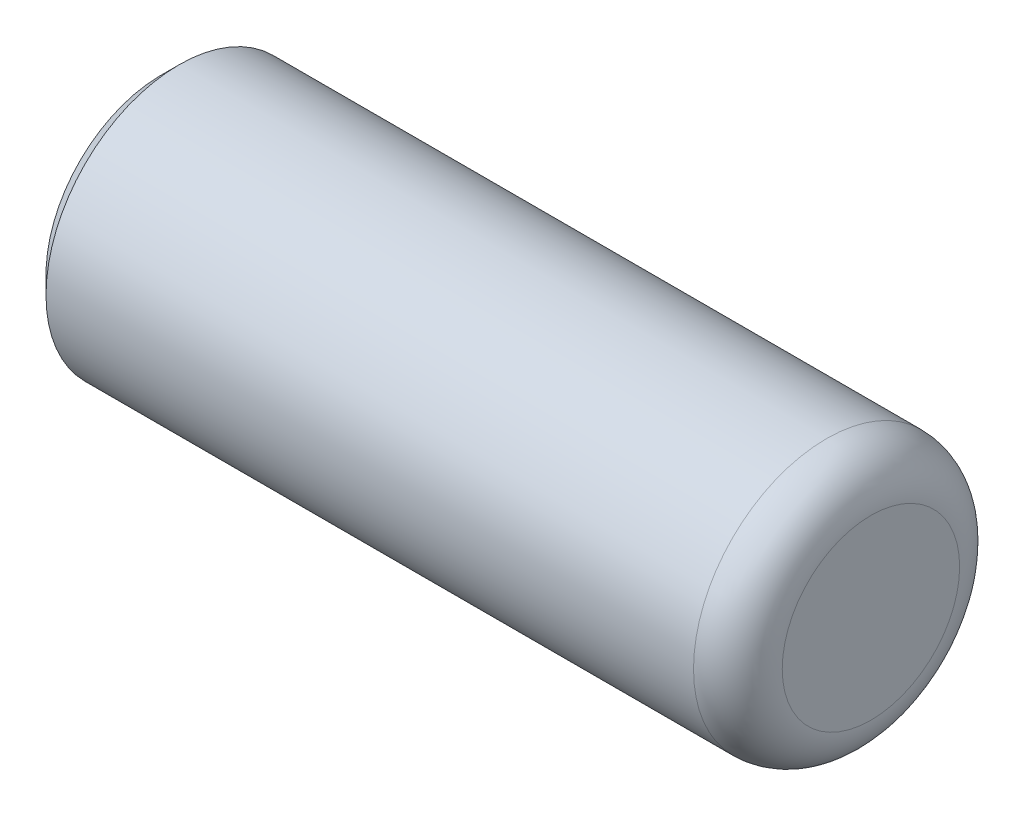
ISO-10303-21;
HEADER;
FILE_DESCRIPTION(('STEP AP214'),'2;1');
FILE_NAME('part.step','',(''),(''),'','','');
FILE_SCHEMA(('AUTOMOTIVE_DESIGN { 1 0 10303 214 1 1 1 1 }'));
ENDSEC;
DATA;
#1=APPLICATION_CONTEXT('core data for automotive mechanical design processes');
#2=APPLICATION_PROTOCOL_DEFINITION('international standard','automotive_design',2000,#1);
#3=PRODUCT_CONTEXT('',#1,'mechanical');
#4=PRODUCT('Part','Part','',(#3));
#5=PRODUCT_RELATED_PRODUCT_CATEGORY('part','',(#4));
#6=PRODUCT_DEFINITION_FORMATION('','',#4);
#7=PRODUCT_DEFINITION_CONTEXT('part definition',#1,'design');
#8=PRODUCT_DEFINITION('design','',#6,#7);
#9=PRODUCT_DEFINITION_SHAPE('','',#8);
#10=(LENGTH_UNIT() NAMED_UNIT(*) SI_UNIT(.MILLI.,.METRE.));
#11=(NAMED_UNIT(*) PLANE_ANGLE_UNIT() SI_UNIT($,.RADIAN.));
#12=(NAMED_UNIT(*) SI_UNIT($,.STERADIAN.) SOLID_ANGLE_UNIT());
#13=UNCERTAINTY_MEASURE_WITH_UNIT(LENGTH_MEASURE(1.E-05),#10,'distance_accuracy_value','');
#14=(GEOMETRIC_REPRESENTATION_CONTEXT(3) GLOBAL_UNCERTAINTY_ASSIGNED_CONTEXT((#13)) GLOBAL_UNIT_ASSIGNED_CONTEXT((#10,
#11,#12)) REPRESENTATION_CONTEXT('',''));
#15=CARTESIAN_POINT('',(0.,0.,0.));
#16=DIRECTION('',(0.,0.,1.));
#17=DIRECTION('',(1.,0.,0.));
#18=AXIS2_PLACEMENT_3D('',#15,#16,#17);
#19=CARTESIAN_POINT('',(4.,0.,0.));
#20=DIRECTION('',(-1.,0.,0.));
#21=DIRECTION('',(0.,0.,1.));
#22=AXIS2_PLACEMENT_3D('',#19,#20,#21);
#23=CYLINDRICAL_SURFACE('',#22,1.5);
#24=CARTESIAN_POINT('',(-3.8,0.,0.));
#25=DIRECTION('',(1.,0.,0.));
#26=DIRECTION('',(0.,0.,-1.));
#27=AXIS2_PLACEMENT_3D('',#24,#25,#26);
#28=CIRCLE('',#27,1.5);
#29=CARTESIAN_POINT('',(-3.8,0.,-1.5));
#30=VERTEX_POINT('',#29);
#31=EDGE_CURVE('E55',#30,#30,#28,.T.);
#32=ORIENTED_EDGE('',*,*,#31,.T.);
#33=EDGE_LOOP('',(#32));
#34=FACE_BOUND('',#33,.T.);
#35=CARTESIAN_POINT('',(3.5,0.,0.));
#36=DIRECTION('',(1.,0.,0.));
#37=DIRECTION('',(0.,0.,-1.));
#38=AXIS2_PLACEMENT_3D('',#35,#36,#37);
#39=CIRCLE('',#38,1.5);
#40=CARTESIAN_POINT('',(3.5,0.,-1.5));
#41=VERTEX_POINT('',#40);
#42=EDGE_CURVE('E59',#41,#41,#39,.F.);
#43=ORIENTED_EDGE('',*,*,#42,.T.);
#44=EDGE_LOOP('',(#43));
#45=FACE_BOUND('',#44,.T.);
#46=ADVANCED_FACE('F47',(#34,#45),#23,.T.);
#47=CARTESIAN_POINT('',(4.,0.,0.));
#48=DIRECTION('',(1.,0.,0.));
#49=DIRECTION('',(0.,0.,-1.));
#50=AXIS2_PLACEMENT_3D('',#47,#48,#49);
#51=PLANE('',#50);
#52=CARTESIAN_POINT('',(4.,0.,0.));
#53=DIRECTION('',(1.,0.,0.));
#54=DIRECTION('',(0.,0.,-1.));
#55=AXIS2_PLACEMENT_3D('',#52,#53,#54);
#56=CIRCLE('',#55,1.);
#57=CARTESIAN_POINT('',(4.,0.,-1.));
#58=VERTEX_POINT('',#57);
#59=EDGE_CURVE('E63',#58,#58,#56,.T.);
#60=ORIENTED_EDGE('',*,*,#59,.T.);
#61=EDGE_LOOP('',(#60));
#62=FACE_BOUND('',#61,.T.);
#63=ADVANCED_FACE('F69',(#62),#51,.T.);
#64=CARTESIAN_POINT('',(-4.,0.,0.));
#65=DIRECTION('',(1.,0.,0.));
#66=DIRECTION('',(0.,0.,-1.));
#67=AXIS2_PLACEMENT_3D('',#64,#65,#66);
#68=PLANE('',#67);
#69=CARTESIAN_POINT('',(-4.,0.,0.));
#70=DIRECTION('',(1.,0.,0.));
#71=DIRECTION('',(0.,0.,-1.));
#72=AXIS2_PLACEMENT_3D('',#69,#70,#71);
#73=CIRCLE('',#72,1.3);
#74=CARTESIAN_POINT('',(-4.,0.,-1.3));
#75=VERTEX_POINT('',#74);
#76=EDGE_CURVE('E12',#75,#75,#73,.F.);
#77=ORIENTED_EDGE('',*,*,#76,.T.);
#78=EDGE_LOOP('',(#77));
#79=FACE_BOUND('',#78,.T.);
#80=ADVANCED_FACE('F73',(#79),#68,.F.);
#81=CARTESIAN_POINT('',(3.5,0.,0.));
#82=DIRECTION('',(1.,0.,0.));
#83=DIRECTION('',(0.,0.,-1.));
#84=AXIS2_PLACEMENT_3D('',#81,#82,#83);
#85=TOROIDAL_SURFACE('',#84,1.,0.5);
#86=ORIENTED_EDGE('',*,*,#42,.F.);
#87=EDGE_LOOP('',(#86));
#88=FACE_BOUND('',#87,.T.);
#89=ORIENTED_EDGE('',*,*,#59,.F.);
#90=EDGE_LOOP('',(#89));
#91=FACE_BOUND('',#90,.T.);
#92=ADVANCED_FACE('F71',(#88,#91),#85,.T.);
#93=CARTESIAN_POINT('',(-3.8,0.,0.));
#94=DIRECTION('',(1.,0.,0.));
#95=DIRECTION('',(0.,0.,-1.));
#96=AXIS2_PLACEMENT_3D('',#93,#94,#95);
#97=CONICAL_SURFACE('',#96,1.5,0.785398163397451);
#98=ORIENTED_EDGE('',*,*,#76,.F.);
#99=EDGE_LOOP('',(#98));
#100=FACE_BOUND('',#99,.T.);
#101=ORIENTED_EDGE('',*,*,#31,.F.);
#102=EDGE_LOOP('',(#101));
#103=FACE_BOUND('',#102,.T.);
#104=ADVANCED_FACE('F50',(#100,#103),#97,.T.);
#105=CLOSED_SHELL('',(#46,#63,#80,#92,#104));
#106=MANIFOLD_SOLID_BREP('B2',#105);
#107=ADVANCED_BREP_SHAPE_REPRESENTATION('',(#18,#106),#14);
#108=SHAPE_DEFINITION_REPRESENTATION(#9,#107);
ENDSEC;
END-ISO-10303-21;
